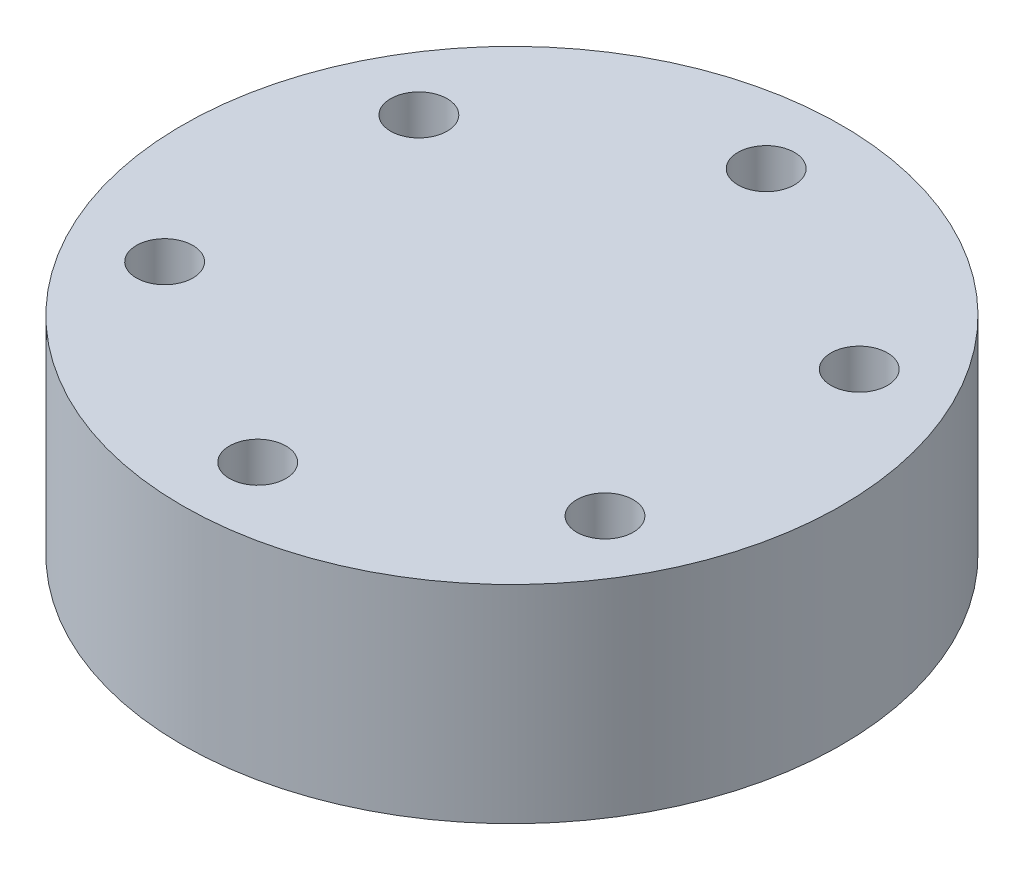
ISO-10303-21;
HEADER;
FILE_DESCRIPTION(('STEP AP214'),'2;1');
FILE_NAME('part.step','',(''),(''),'','','');
FILE_SCHEMA(('AUTOMOTIVE_DESIGN { 1 0 10303 214 1 1 1 1 }'));
ENDSEC;
DATA;
#1=APPLICATION_CONTEXT('core data for automotive mechanical design processes');
#2=APPLICATION_PROTOCOL_DEFINITION('international standard','automotive_design',2000,#1);
#3=PRODUCT_CONTEXT('',#1,'mechanical');
#4=PRODUCT('Part','Part','',(#3));
#5=PRODUCT_RELATED_PRODUCT_CATEGORY('part','',(#4));
#6=PRODUCT_DEFINITION_FORMATION('','',#4);
#7=PRODUCT_DEFINITION_CONTEXT('part definition',#1,'design');
#8=PRODUCT_DEFINITION('design','',#6,#7);
#9=PRODUCT_DEFINITION_SHAPE('','',#8);
#10=(LENGTH_UNIT() NAMED_UNIT(*) SI_UNIT(.MILLI.,.METRE.));
#11=(NAMED_UNIT(*) PLANE_ANGLE_UNIT() SI_UNIT($,.RADIAN.));
#12=(NAMED_UNIT(*) SI_UNIT($,.STERADIAN.) SOLID_ANGLE_UNIT());
#13=UNCERTAINTY_MEASURE_WITH_UNIT(LENGTH_MEASURE(1.E-05),#10,'distance_accuracy_value','');
#14=(GEOMETRIC_REPRESENTATION_CONTEXT(3) GLOBAL_UNCERTAINTY_ASSIGNED_CONTEXT((#13)) GLOBAL_UNIT_ASSIGNED_CONTEXT((#10,
#11,#12)) REPRESENTATION_CONTEXT('',''));
#15=CARTESIAN_POINT('',(0.,0.,0.));
#16=DIRECTION('',(0.,0.,1.));
#17=DIRECTION('',(1.,0.,0.));
#18=AXIS2_PLACEMENT_3D('',#15,#16,#17);
#19=CARTESIAN_POINT('',(0.,11.,0.));
#20=DIRECTION('',(0.,-1.,0.));
#21=DIRECTION('',(0.,0.,-1.));
#22=AXIS2_PLACEMENT_3D('',#19,#20,#21);
#23=CYLINDRICAL_SURFACE('',#22,17.5);
#24=CARTESIAN_POINT('',(0.,11.,0.));
#25=DIRECTION('',(0.,1.,0.));
#26=DIRECTION('',(0.,0.,1.));
#27=AXIS2_PLACEMENT_3D('',#24,#25,#26);
#28=CIRCLE('',#27,17.5);
#29=CARTESIAN_POINT('',(0.,11.,17.5));
#30=VERTEX_POINT('',#29);
#31=EDGE_CURVE('E10',#30,#30,#28,.T.);
#32=ORIENTED_EDGE('',*,*,#31,.F.);
#33=EDGE_LOOP('',(#32));
#34=FACE_BOUND('',#33,.T.);
#35=CARTESIAN_POINT('',(0.,0.,0.));
#36=DIRECTION('',(0.,1.,0.));
#37=DIRECTION('',(0.,0.,1.));
#38=AXIS2_PLACEMENT_3D('',#35,#36,#37);
#39=CIRCLE('',#38,17.5);
#40=CARTESIAN_POINT('',(0.,0.,17.5));
#41=VERTEX_POINT('',#40);
#42=EDGE_CURVE('E37',#41,#41,#39,.T.);
#43=ORIENTED_EDGE('',*,*,#42,.T.);
#44=EDGE_LOOP('',(#43));
#45=FACE_BOUND('',#44,.T.);
#46=ADVANCED_FACE('F34',(#34,#45),#23,.T.);
#47=CARTESIAN_POINT('',(0.,11.,0.));
#48=DIRECTION('',(0.,1.,0.));
#49=DIRECTION('',(0.,0.,1.));
#50=AXIS2_PLACEMENT_3D('',#47,#48,#49);
#51=PLANE('',#50);
#52=CARTESIAN_POINT('',(11.6913429510902,11.,-6.7500000000005));
#53=DIRECTION('',(0.,1.,0.));
#54=DIRECTION('',(0.,0.,1.));
#55=AXIS2_PLACEMENT_3D('',#52,#53,#54);
#56=CIRCLE('',#55,1.50000000000016);
#57=CARTESIAN_POINT('',(11.6913429510902,11.,-5.25000000000034));
#58=VERTEX_POINT('',#57);
#59=EDGE_CURVE('E76',#58,#58,#56,.T.);
#60=ORIENTED_EDGE('',*,*,#59,.F.);
#61=EDGE_LOOP('',(#60));
#62=FACE_BOUND('',#61,.T.);
#63=CARTESIAN_POINT('',(11.6913429510908,11.,6.7499999999995));
#64=DIRECTION('',(0.,1.,0.));
#65=DIRECTION('',(0.,0.,1.));
#66=AXIS2_PLACEMENT_3D('',#63,#64,#65);
#67=CIRCLE('',#66,1.50000000000074);
#68=CARTESIAN_POINT('',(11.6913429510908,11.,8.25000000000024));
#69=VERTEX_POINT('',#68);
#70=EDGE_CURVE('E70',#69,#69,#67,.T.);
#71=ORIENTED_EDGE('',*,*,#70,.F.);
#72=EDGE_LOOP('',(#71));
#73=FACE_BOUND('',#72,.T.);
#74=CARTESIAN_POINT('',(1.14777268557366E-12,11.,13.5));
#75=DIRECTION('',(0.,1.,0.));
#76=DIRECTION('',(0.,0.,1.));
#77=AXIS2_PLACEMENT_3D('',#74,#75,#76);
#78=CIRCLE('',#77,1.50000000000119);
#79=CARTESIAN_POINT('',(1.14777268557366E-12,11.,15.0000000000012));
#80=VERTEX_POINT('',#79);
#81=EDGE_CURVE('E64',#80,#80,#78,.T.);
#82=ORIENTED_EDGE('',*,*,#81,.F.);
#83=EDGE_LOOP('',(#82));
#84=FACE_BOUND('',#83,.T.);
#85=CARTESIAN_POINT('',(-11.6913429510891,11.,6.7500000000005));
#86=DIRECTION('',(0.,1.,0.));
#87=DIRECTION('',(0.,0.,1.));
#88=AXIS2_PLACEMENT_3D('',#85,#86,#87);
#89=CIRCLE('',#88,1.50000000000109);
#90=CARTESIAN_POINT('',(-11.6913429510891,11.,8.2500000000016));
#91=VERTEX_POINT('',#90);
#92=EDGE_CURVE('E58',#91,#91,#89,.T.);
#93=ORIENTED_EDGE('',*,*,#92,.F.);
#94=EDGE_LOOP('',(#93));
#95=FACE_BOUND('',#94,.T.);
#96=CARTESIAN_POINT('',(-11.6913429510896,11.,-6.74999999999949));
#97=DIRECTION('',(0.,1.,0.));
#98=DIRECTION('',(0.,0.,1.));
#99=AXIS2_PLACEMENT_3D('',#96,#97,#98);
#100=CIRCLE('',#99,1.50000000000058);
#101=CARTESIAN_POINT('',(-11.6913429510896,11.,-5.24999999999891));
#102=VERTEX_POINT('',#101);
#103=EDGE_CURVE('E52',#102,#102,#100,.T.);
#104=ORIENTED_EDGE('',*,*,#103,.F.);
#105=EDGE_LOOP('',(#104));
#106=FACE_BOUND('',#105,.T.);
#107=CARTESIAN_POINT('',(0.,11.,-13.5));
#108=DIRECTION('',(0.,1.,0.));
#109=DIRECTION('',(0.,0.,1.));
#110=AXIS2_PLACEMENT_3D('',#107,#108,#109);
#111=CIRCLE('',#110,1.5);
#112=CARTESIAN_POINT('',(0.,11.,-12.));
#113=VERTEX_POINT('',#112);
#114=EDGE_CURVE('E46',#113,#113,#111,.T.);
#115=ORIENTED_EDGE('',*,*,#114,.F.);
#116=EDGE_LOOP('',(#115));
#117=FACE_BOUND('',#116,.T.);
#118=ORIENTED_EDGE('',*,*,#31,.T.);
#119=EDGE_LOOP('',(#118));
#120=FACE_BOUND('',#119,.T.);
#121=ADVANCED_FACE('F92',(#62,#73,#84,#95,#106,#117,#120),#51,.T.);
#122=CARTESIAN_POINT('',(0.,0.,0.));
#123=DIRECTION('',(0.,1.,0.));
#124=DIRECTION('',(0.,0.,1.));
#125=AXIS2_PLACEMENT_3D('',#122,#123,#124);
#126=PLANE('',#125);
#127=CARTESIAN_POINT('',(11.6913429510902,0.,-6.7500000000005));
#128=DIRECTION('',(0.,1.,0.));
#129=DIRECTION('',(0.,0.,1.));
#130=AXIS2_PLACEMENT_3D('',#127,#128,#129);
#131=CIRCLE('',#130,1.50000000000016);
#132=CARTESIAN_POINT('',(11.6913429510902,0.,-5.25000000000034));
#133=VERTEX_POINT('',#132);
#134=EDGE_CURVE('E49',#133,#133,#131,.T.);
#135=ORIENTED_EDGE('',*,*,#134,.T.);
#136=EDGE_LOOP('',(#135));
#137=FACE_BOUND('',#136,.T.);
#138=CARTESIAN_POINT('',(11.6913429510908,0.,6.7499999999995));
#139=DIRECTION('',(0.,1.,0.));
#140=DIRECTION('',(0.,0.,1.));
#141=AXIS2_PLACEMENT_3D('',#138,#139,#140);
#142=CIRCLE('',#141,1.50000000000074);
#143=CARTESIAN_POINT('',(11.6913429510908,0.,8.25000000000024));
#144=VERTEX_POINT('',#143);
#145=EDGE_CURVE('E73',#144,#144,#142,.T.);
#146=ORIENTED_EDGE('',*,*,#145,.T.);
#147=EDGE_LOOP('',(#146));
#148=FACE_BOUND('',#147,.T.);
#149=CARTESIAN_POINT('',(1.14777268557366E-12,0.,13.5));
#150=DIRECTION('',(0.,1.,0.));
#151=DIRECTION('',(0.,0.,1.));
#152=AXIS2_PLACEMENT_3D('',#149,#150,#151);
#153=CIRCLE('',#152,1.50000000000119);
#154=CARTESIAN_POINT('',(1.14777268557366E-12,0.,15.0000000000012));
#155=VERTEX_POINT('',#154);
#156=EDGE_CURVE('E67',#155,#155,#153,.T.);
#157=ORIENTED_EDGE('',*,*,#156,.T.);
#158=EDGE_LOOP('',(#157));
#159=FACE_BOUND('',#158,.T.);
#160=CARTESIAN_POINT('',(-11.6913429510891,0.,6.7500000000005));
#161=DIRECTION('',(0.,1.,0.));
#162=DIRECTION('',(0.,0.,1.));
#163=AXIS2_PLACEMENT_3D('',#160,#161,#162);
#164=CIRCLE('',#163,1.50000000000109);
#165=CARTESIAN_POINT('',(-11.6913429510891,0.,8.2500000000016));
#166=VERTEX_POINT('',#165);
#167=EDGE_CURVE('E61',#166,#166,#164,.T.);
#168=ORIENTED_EDGE('',*,*,#167,.T.);
#169=EDGE_LOOP('',(#168));
#170=FACE_BOUND('',#169,.T.);
#171=CARTESIAN_POINT('',(-11.6913429510896,0.,-6.74999999999949));
#172=DIRECTION('',(0.,1.,0.));
#173=DIRECTION('',(0.,0.,1.));
#174=AXIS2_PLACEMENT_3D('',#171,#172,#173);
#175=CIRCLE('',#174,1.50000000000058);
#176=CARTESIAN_POINT('',(-11.6913429510896,0.,-5.24999999999891));
#177=VERTEX_POINT('',#176);
#178=EDGE_CURVE('E55',#177,#177,#175,.T.);
#179=ORIENTED_EDGE('',*,*,#178,.T.);
#180=EDGE_LOOP('',(#179));
#181=FACE_BOUND('',#180,.T.);
#182=CARTESIAN_POINT('',(0.,0.,-13.5));
#183=DIRECTION('',(0.,1.,0.));
#184=DIRECTION('',(0.,0.,1.));
#185=AXIS2_PLACEMENT_3D('',#182,#183,#184);
#186=CIRCLE('',#185,1.5);
#187=CARTESIAN_POINT('',(0.,0.,-12.));
#188=VERTEX_POINT('',#187);
#189=EDGE_CURVE('E44',#188,#188,#186,.T.);
#190=ORIENTED_EDGE('',*,*,#189,.T.);
#191=EDGE_LOOP('',(#190));
#192=FACE_BOUND('',#191,.T.);
#193=ORIENTED_EDGE('',*,*,#42,.F.);
#194=EDGE_LOOP('',(#193));
#195=FACE_BOUND('',#194,.T.);
#196=ADVANCED_FACE('F82',(#137,#148,#159,#170,#181,#192,#195),#126,.F.);
#197=CARTESIAN_POINT('',(0.,0.,-13.5));
#198=DIRECTION('',(0.,1.,0.));
#199=DIRECTION('',(0.,0.,1.));
#200=AXIS2_PLACEMENT_3D('',#197,#198,#199);
#201=CYLINDRICAL_SURFACE('',#200,1.5);
#202=ORIENTED_EDGE('',*,*,#189,.F.);
#203=EDGE_LOOP('',(#202));
#204=FACE_BOUND('',#203,.T.);
#205=ORIENTED_EDGE('',*,*,#114,.T.);
#206=EDGE_LOOP('',(#205));
#207=FACE_BOUND('',#206,.T.);
#208=ADVANCED_FACE('F106',(#204,#207),#201,.F.);
#209=CARTESIAN_POINT('',(-11.6913429510896,0.,-6.74999999999949));
#210=DIRECTION('',(0.,1.,0.));
#211=DIRECTION('',(0.,0.,1.));
#212=AXIS2_PLACEMENT_3D('',#209,#210,#211);
#213=CYLINDRICAL_SURFACE('',#212,1.50000000000058);
#214=ORIENTED_EDGE('',*,*,#178,.F.);
#215=EDGE_LOOP('',(#214));
#216=FACE_BOUND('',#215,.T.);
#217=ORIENTED_EDGE('',*,*,#103,.T.);
#218=EDGE_LOOP('',(#217));
#219=FACE_BOUND('',#218,.T.);
#220=ADVANCED_FACE('F108',(#216,#219),#213,.F.);
#221=CARTESIAN_POINT('',(-11.6913429510891,0.,6.7500000000005));
#222=DIRECTION('',(0.,1.,0.));
#223=DIRECTION('',(0.,0.,1.));
#224=AXIS2_PLACEMENT_3D('',#221,#222,#223);
#225=CYLINDRICAL_SURFACE('',#224,1.50000000000109);
#226=ORIENTED_EDGE('',*,*,#167,.F.);
#227=EDGE_LOOP('',(#226));
#228=FACE_BOUND('',#227,.T.);
#229=ORIENTED_EDGE('',*,*,#92,.T.);
#230=EDGE_LOOP('',(#229));
#231=FACE_BOUND('',#230,.T.);
#232=ADVANCED_FACE('F115',(#228,#231),#225,.F.);
#233=CARTESIAN_POINT('',(1.14777268557366E-12,0.,13.5));
#234=DIRECTION('',(0.,1.,0.));
#235=DIRECTION('',(0.,0.,1.));
#236=AXIS2_PLACEMENT_3D('',#233,#234,#235);
#237=CYLINDRICAL_SURFACE('',#236,1.50000000000119);
#238=ORIENTED_EDGE('',*,*,#156,.F.);
#239=EDGE_LOOP('',(#238));
#240=FACE_BOUND('',#239,.T.);
#241=ORIENTED_EDGE('',*,*,#81,.T.);
#242=EDGE_LOOP('',(#241));
#243=FACE_BOUND('',#242,.T.);
#244=ADVANCED_FACE('F153',(#240,#243),#237,.F.);
#245=CARTESIAN_POINT('',(11.6913429510908,0.,6.7499999999995));
#246=DIRECTION('',(0.,1.,0.));
#247=DIRECTION('',(0.,0.,1.));
#248=AXIS2_PLACEMENT_3D('',#245,#246,#247);
#249=CYLINDRICAL_SURFACE('',#248,1.50000000000074);
#250=ORIENTED_EDGE('',*,*,#145,.F.);
#251=EDGE_LOOP('',(#250));
#252=FACE_BOUND('',#251,.T.);
#253=ORIENTED_EDGE('',*,*,#70,.T.);
#254=EDGE_LOOP('',(#253));
#255=FACE_BOUND('',#254,.T.);
#256=ADVANCED_FACE('F88',(#252,#255),#249,.F.);
#257=CARTESIAN_POINT('',(11.6913429510902,0.,-6.7500000000005));
#258=DIRECTION('',(0.,1.,0.));
#259=DIRECTION('',(0.,0.,1.));
#260=AXIS2_PLACEMENT_3D('',#257,#258,#259);
#261=CYLINDRICAL_SURFACE('',#260,1.50000000000016);
#262=ORIENTED_EDGE('',*,*,#134,.F.);
#263=EDGE_LOOP('',(#262));
#264=FACE_BOUND('',#263,.T.);
#265=ORIENTED_EDGE('',*,*,#59,.T.);
#266=EDGE_LOOP('',(#265));
#267=FACE_BOUND('',#266,.T.);
#268=ADVANCED_FACE('F85',(#264,#267),#261,.F.);
#269=CLOSED_SHELL('',(#46,#121,#196,#208,#220,#232,#244,#256,#268));
#270=MANIFOLD_SOLID_BREP('B2',#269);
#271=ADVANCED_BREP_SHAPE_REPRESENTATION('',(#18,#270),#14);
#272=SHAPE_DEFINITION_REPRESENTATION(#9,#271);
ENDSEC;
END-ISO-10303-21;
